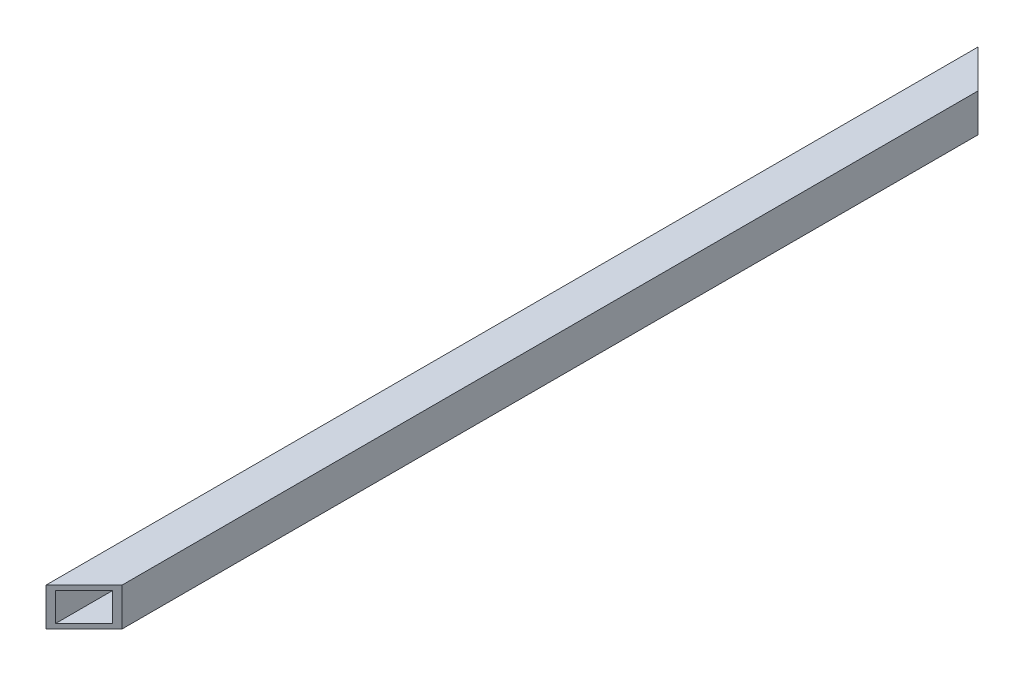
ISO-10303-21;
HEADER;
FILE_DESCRIPTION(('STEP AP214'),'2;1');
FILE_NAME('part.step','',(''),(''),'','','');
FILE_SCHEMA(('AUTOMOTIVE_DESIGN { 1 0 10303 214 1 1 1 1 }'));
ENDSEC;
DATA;
#1=APPLICATION_CONTEXT('core data for automotive mechanical design processes');
#2=APPLICATION_PROTOCOL_DEFINITION('international standard','automotive_design',2000,#1);
#3=PRODUCT_CONTEXT('',#1,'mechanical');
#4=PRODUCT('Part','Part','',(#3));
#5=PRODUCT_RELATED_PRODUCT_CATEGORY('part','',(#4));
#6=PRODUCT_DEFINITION_FORMATION('','',#4);
#7=PRODUCT_DEFINITION_CONTEXT('part definition',#1,'design');
#8=PRODUCT_DEFINITION('design','',#6,#7);
#9=PRODUCT_DEFINITION_SHAPE('','',#8);
#10=(LENGTH_UNIT() NAMED_UNIT(*) SI_UNIT(.MILLI.,.METRE.));
#11=(NAMED_UNIT(*) PLANE_ANGLE_UNIT() SI_UNIT($,.RADIAN.));
#12=(NAMED_UNIT(*) SI_UNIT($,.STERADIAN.) SOLID_ANGLE_UNIT());
#13=UNCERTAINTY_MEASURE_WITH_UNIT(LENGTH_MEASURE(1.E-05),#10,'distance_accuracy_value','');
#14=(GEOMETRIC_REPRESENTATION_CONTEXT(3) GLOBAL_UNCERTAINTY_ASSIGNED_CONTEXT((#13)) GLOBAL_UNIT_ASSIGNED_CONTEXT((#10,
#11,#12)) REPRESENTATION_CONTEXT('',''));
#15=CARTESIAN_POINT('',(0.,0.,0.));
#16=DIRECTION('',(0.,0.,1.));
#17=DIRECTION('',(1.,0.,0.));
#18=AXIS2_PLACEMENT_3D('',#15,#16,#17);
#19=CARTESIAN_POINT('',(-12.7,12.7,-311.15));
#20=DIRECTION('',(-0.70710678118655,0.,0.707106781186545));
#21=DIRECTION('',(0.707106781186545,0.,0.70710678118655));
#22=AXIS2_PLACEMENT_3D('',#19,#20,#21);
#23=PLANE('',#22);
#24=DIRECTION('',(0.707106781186545,0.,0.70710678118655));
#25=VECTOR('',#24,1.);
#26=CARTESIAN_POINT('',(71.4375,-12.7,-227.0125));
#27=LINE('',#26,#25);
#28=CARTESIAN_POINT('',(-12.7,-12.7,-311.15));
#29=VERTEX_POINT('',#28);
#30=CARTESIAN_POINT('',(12.7,-12.7,-285.75));
#31=VERTEX_POINT('',#30);
#32=EDGE_CURVE('E10',#29,#31,#27,.T.);
#33=ORIENTED_EDGE('',*,*,#32,.F.);
#34=DIRECTION('',(0.,-1.,0.));
#35=VECTOR('',#34,1.);
#36=CARTESIAN_POINT('',(-12.7,-12.7,-311.15));
#37=LINE('',#36,#35);
#38=CARTESIAN_POINT('',(-12.7,12.7,-311.15));
#39=VERTEX_POINT('',#38);
#40=EDGE_CURVE('E35',#39,#29,#37,.T.);
#41=ORIENTED_EDGE('',*,*,#40,.F.);
#42=DIRECTION('',(-0.707106781186545,0.,-0.70710678118655));
#43=VECTOR('',#42,1.);
#44=CARTESIAN_POINT('',(65.0875,12.7,-233.362499999999));
#45=LINE('',#44,#43);
#46=CARTESIAN_POINT('',(12.6999999999998,12.7,-285.75));
#47=VERTEX_POINT('',#46);
#48=EDGE_CURVE('E130',#47,#39,#45,.T.);
#49=ORIENTED_EDGE('',*,*,#48,.F.);
#50=DIRECTION('',(0.,1.,0.));
#51=VECTOR('',#50,1.);
#52=CARTESIAN_POINT('',(12.7,12.7,-285.75));
#53=LINE('',#52,#51);
#54=EDGE_CURVE('E114',#31,#47,#53,.T.);
#55=ORIENTED_EDGE('',*,*,#54,.F.);
#56=EDGE_LOOP('',(#33,#41,#49,#55));
#57=FACE_BOUND('',#56,.T.);
#58=DIRECTION('',(0.,-1.,0.));
#59=VECTOR('',#58,1.);
#60=CARTESIAN_POINT('',(9.52500000000001,11.1125,-288.925));
#61=LINE('',#60,#59);
#62=CARTESIAN_POINT('',(9.525,9.525,-288.925));
#63=VERTEX_POINT('',#62);
#64=CARTESIAN_POINT('',(9.525,-9.525,-288.925));
#65=VERTEX_POINT('',#64);
#66=EDGE_CURVE('E92',#63,#65,#61,.T.);
#67=ORIENTED_EDGE('',*,*,#66,.F.);
#68=DIRECTION('',(0.707106781186545,0.,0.70710678118655));
#69=VECTOR('',#68,1.);
#70=CARTESIAN_POINT('',(65.88125,9.525,-232.56875));
#71=LINE('',#70,#69);
#72=CARTESIAN_POINT('',(-9.525,9.525,-307.975));
#73=VERTEX_POINT('',#72);
#74=EDGE_CURVE('E100',#73,#63,#71,.T.);
#75=ORIENTED_EDGE('',*,*,#74,.F.);
#76=DIRECTION('',(0.,1.,0.));
#77=VECTOR('',#76,1.);
#78=CARTESIAN_POINT('',(-9.52500000000001,1.5875,-307.975));
#79=LINE('',#78,#77);
#80=CARTESIAN_POINT('',(-9.525,-9.525,-307.975));
#81=VERTEX_POINT('',#80);
#82=EDGE_CURVE('E101',#81,#73,#79,.T.);
#83=ORIENTED_EDGE('',*,*,#82,.F.);
#84=DIRECTION('',(-0.707106781186545,0.,-0.70710678118655));
#85=VECTOR('',#84,1.);
#86=CARTESIAN_POINT('',(70.64375,-9.525,-227.80625));
#87=LINE('',#86,#85);
#88=EDGE_CURVE('E111',#65,#81,#87,.T.);
#89=ORIENTED_EDGE('',*,*,#88,.F.);
#90=EDGE_LOOP('',(#67,#75,#83,#89));
#91=FACE_BOUND('',#90,.T.);
#92=ADVANCED_FACE('F16',(#57,#91),#23,.F.);
#93=CARTESIAN_POINT('',(12.7,12.7,285.75));
#94=DIRECTION('',(-0.707106781186548,0.,-0.707106781186547));
#95=DIRECTION('',(-0.707106781186547,0.,0.707106781186548));
#96=AXIS2_PLACEMENT_3D('',#93,#94,#95);
#97=PLANE('',#96);
#98=DIRECTION('',(-0.707106781186547,0.,0.707106781186548));
#99=VECTOR('',#98,1.);
#100=CARTESIAN_POINT('',(84.1375,-12.7,214.3125));
#101=LINE('',#100,#99);
#102=CARTESIAN_POINT('',(12.7,-12.7,285.75));
#103=VERTEX_POINT('',#102);
#104=CARTESIAN_POINT('',(-12.7,-12.7,311.15));
#105=VERTEX_POINT('',#104);
#106=EDGE_CURVE('E26',#103,#105,#101,.T.);
#107=ORIENTED_EDGE('',*,*,#106,.F.);
#108=DIRECTION('',(0.,-1.,0.));
#109=VECTOR('',#108,1.);
#110=CARTESIAN_POINT('',(12.7,12.7,285.75));
#111=LINE('',#110,#109);
#112=CARTESIAN_POINT('',(12.7,12.7,285.75));
#113=VERTEX_POINT('',#112);
#114=EDGE_CURVE('E117',#113,#103,#111,.T.);
#115=ORIENTED_EDGE('',*,*,#114,.F.);
#116=DIRECTION('',(0.707106781186547,0.,-0.707106781186548));
#117=VECTOR('',#116,1.);
#118=CARTESIAN_POINT('',(77.7875,12.7,220.6625));
#119=LINE('',#118,#117);
#120=CARTESIAN_POINT('',(-12.7,12.7,311.15));
#121=VERTEX_POINT('',#120);
#122=EDGE_CURVE('E133',#121,#113,#119,.T.);
#123=ORIENTED_EDGE('',*,*,#122,.F.);
#124=DIRECTION('',(0.,1.,0.));
#125=VECTOR('',#124,1.);
#126=CARTESIAN_POINT('',(-12.7,-12.7,311.15));
#127=LINE('',#126,#125);
#128=EDGE_CURVE('E126',#105,#121,#127,.T.);
#129=ORIENTED_EDGE('',*,*,#128,.F.);
#130=EDGE_LOOP('',(#107,#115,#123,#129));
#131=FACE_BOUND('',#130,.T.);
#132=DIRECTION('',(0.,1.,0.));
#133=VECTOR('',#132,1.);
#134=CARTESIAN_POINT('',(9.52500000000001,11.1125,288.925));
#135=LINE('',#134,#133);
#136=CARTESIAN_POINT('',(9.525,-9.525,288.925));
#137=VERTEX_POINT('',#136);
#138=CARTESIAN_POINT('',(9.525,9.525,288.925));
#139=VERTEX_POINT('',#138);
#140=EDGE_CURVE('E120',#137,#139,#135,.T.);
#141=ORIENTED_EDGE('',*,*,#140,.F.);
#142=DIRECTION('',(0.707106781186547,0.,-0.707106781186548));
#143=VECTOR('',#142,1.);
#144=CARTESIAN_POINT('',(83.34375,-9.525,215.10625));
#145=LINE('',#144,#143);
#146=CARTESIAN_POINT('',(-9.525,-9.525,307.975));
#147=VERTEX_POINT('',#146);
#148=EDGE_CURVE('E79',#147,#137,#145,.T.);
#149=ORIENTED_EDGE('',*,*,#148,.F.);
#150=DIRECTION('',(0.,-1.,0.));
#151=VECTOR('',#150,1.);
#152=CARTESIAN_POINT('',(-9.52499999999998,1.5875,307.975));
#153=LINE('',#152,#151);
#154=CARTESIAN_POINT('',(-9.525,9.525,307.975));
#155=VERTEX_POINT('',#154);
#156=EDGE_CURVE('E82',#155,#147,#153,.T.);
#157=ORIENTED_EDGE('',*,*,#156,.F.);
#158=DIRECTION('',(-0.707106781186547,0.,0.707106781186548));
#159=VECTOR('',#158,1.);
#160=CARTESIAN_POINT('',(78.58125,9.525,219.86875));
#161=LINE('',#160,#159);
#162=EDGE_CURVE('E85',#139,#155,#161,.T.);
#163=ORIENTED_EDGE('',*,*,#162,.F.);
#164=EDGE_LOOP('',(#141,#149,#157,#163));
#165=FACE_BOUND('',#164,.T.);
#166=ADVANCED_FACE('F84',(#131,#165),#97,.F.);
#167=CARTESIAN_POINT('',(12.7,-12.7,0.));
#168=DIRECTION('',(0.,-1.,0.));
#169=DIRECTION('',(0.,0.,-1.));
#170=AXIS2_PLACEMENT_3D('',#167,#168,#169);
#171=PLANE('',#170);
#172=ORIENTED_EDGE('',*,*,#32,.T.);
#173=DIRECTION('',(0.,0.,-1.));
#174=VECTOR('',#173,1.);
#175=CARTESIAN_POINT('',(12.7,-12.7,0.));
#176=LINE('',#175,#174);
#177=EDGE_CURVE('E123',#103,#31,#176,.T.);
#178=ORIENTED_EDGE('',*,*,#177,.F.);
#179=ORIENTED_EDGE('',*,*,#106,.T.);
#180=DIRECTION('',(0.,0.,-1.));
#181=VECTOR('',#180,1.);
#182=CARTESIAN_POINT('',(-12.7,-12.7,0.));
#183=LINE('',#182,#181);
#184=EDGE_CURVE('E127',#105,#29,#183,.T.);
#185=ORIENTED_EDGE('',*,*,#184,.T.);
#186=EDGE_LOOP('',(#172,#178,#179,#185));
#187=FACE_BOUND('',#186,.T.);
#188=ADVANCED_FACE('F165',(#187),#171,.T.);
#189=CARTESIAN_POINT('',(-12.7,12.7,0.));
#190=DIRECTION('',(0.,1.,0.));
#191=DIRECTION('',(0.,0.,1.));
#192=AXIS2_PLACEMENT_3D('',#189,#190,#191);
#193=PLANE('',#192);
#194=ORIENTED_EDGE('',*,*,#48,.T.);
#195=DIRECTION('',(0.,0.,1.));
#196=VECTOR('',#195,1.);
#197=CARTESIAN_POINT('',(-12.7,12.7,0.));
#198=LINE('',#197,#196);
#199=EDGE_CURVE('E131',#39,#121,#198,.T.);
#200=ORIENTED_EDGE('',*,*,#199,.T.);
#201=ORIENTED_EDGE('',*,*,#122,.T.);
#202=DIRECTION('',(0.,0.,-1.));
#203=VECTOR('',#202,1.);
#204=CARTESIAN_POINT('',(12.7,12.7,0.));
#205=LINE('',#204,#203);
#206=EDGE_CURVE('E134',#113,#47,#205,.T.);
#207=ORIENTED_EDGE('',*,*,#206,.T.);
#208=EDGE_LOOP('',(#194,#200,#201,#207));
#209=FACE_BOUND('',#208,.T.);
#210=ADVANCED_FACE('F150',(#209),#193,.T.);
#211=CARTESIAN_POINT('',(-9.525,9.525,0.));
#212=DIRECTION('',(0.,1.,0.));
#213=DIRECTION('',(0.,0.,1.));
#214=AXIS2_PLACEMENT_3D('',#211,#212,#213);
#215=PLANE('',#214);
#216=ORIENTED_EDGE('',*,*,#74,.T.);
#217=DIRECTION('',(0.,0.,-1.));
#218=VECTOR('',#217,1.);
#219=CARTESIAN_POINT('',(9.525,9.525,0.));
#220=LINE('',#219,#218);
#221=EDGE_CURVE('E99',#139,#63,#220,.T.);
#222=ORIENTED_EDGE('',*,*,#221,.F.);
#223=ORIENTED_EDGE('',*,*,#162,.T.);
#224=DIRECTION('',(0.,0.,1.));
#225=VECTOR('',#224,1.);
#226=CARTESIAN_POINT('',(-9.525,9.525,0.));
#227=LINE('',#226,#225);
#228=EDGE_CURVE('E91',#73,#155,#227,.T.);
#229=ORIENTED_EDGE('',*,*,#228,.F.);
#230=EDGE_LOOP('',(#216,#222,#223,#229));
#231=FACE_BOUND('',#230,.T.);
#232=ADVANCED_FACE('F97',(#231),#215,.F.);
#233=CARTESIAN_POINT('',(-9.525,-9.525,0.));
#234=DIRECTION('',(-1.,0.,0.));
#235=DIRECTION('',(0.,0.,1.));
#236=AXIS2_PLACEMENT_3D('',#233,#234,#235);
#237=PLANE('',#236);
#238=ORIENTED_EDGE('',*,*,#82,.T.);
#239=ORIENTED_EDGE('',*,*,#228,.T.);
#240=ORIENTED_EDGE('',*,*,#156,.T.);
#241=DIRECTION('',(0.,0.,1.));
#242=VECTOR('',#241,1.);
#243=CARTESIAN_POINT('',(-9.525,-9.525,0.));
#244=LINE('',#243,#242);
#245=EDGE_CURVE('E110',#81,#147,#244,.T.);
#246=ORIENTED_EDGE('',*,*,#245,.F.);
#247=EDGE_LOOP('',(#238,#239,#240,#246));
#248=FACE_BOUND('',#247,.T.);
#249=ADVANCED_FACE('F103',(#248),#237,.F.);
#250=CARTESIAN_POINT('',(9.525,9.525,0.));
#251=DIRECTION('',(1.,0.,0.));
#252=DIRECTION('',(0.,0.,-1.));
#253=AXIS2_PLACEMENT_3D('',#250,#251,#252);
#254=PLANE('',#253);
#255=ORIENTED_EDGE('',*,*,#66,.T.);
#256=DIRECTION('',(0.,0.,1.));
#257=VECTOR('',#256,1.);
#258=CARTESIAN_POINT('',(9.525,-9.525,0.));
#259=LINE('',#258,#257);
#260=EDGE_CURVE('E20',#65,#137,#259,.T.);
#261=ORIENTED_EDGE('',*,*,#260,.T.);
#262=ORIENTED_EDGE('',*,*,#140,.T.);
#263=ORIENTED_EDGE('',*,*,#221,.T.);
#264=EDGE_LOOP('',(#255,#261,#262,#263));
#265=FACE_BOUND('',#264,.T.);
#266=ADVANCED_FACE('F179',(#265),#254,.F.);
#267=CARTESIAN_POINT('',(9.525,-9.525,0.));
#268=DIRECTION('',(0.,-1.,0.));
#269=DIRECTION('',(0.,0.,-1.));
#270=AXIS2_PLACEMENT_3D('',#267,#268,#269);
#271=PLANE('',#270);
#272=ORIENTED_EDGE('',*,*,#88,.T.);
#273=ORIENTED_EDGE('',*,*,#245,.T.);
#274=ORIENTED_EDGE('',*,*,#148,.T.);
#275=ORIENTED_EDGE('',*,*,#260,.F.);
#276=EDGE_LOOP('',(#272,#273,#274,#275));
#277=FACE_BOUND('',#276,.T.);
#278=ADVANCED_FACE('F158',(#277),#271,.F.);
#279=CARTESIAN_POINT('',(12.7,12.7,0.));
#280=DIRECTION('',(1.,0.,0.));
#281=DIRECTION('',(0.,0.,-1.));
#282=AXIS2_PLACEMENT_3D('',#279,#280,#281);
#283=PLANE('',#282);
#284=ORIENTED_EDGE('',*,*,#54,.T.);
#285=ORIENTED_EDGE('',*,*,#206,.F.);
#286=ORIENTED_EDGE('',*,*,#114,.T.);
#287=ORIENTED_EDGE('',*,*,#177,.T.);
#288=EDGE_LOOP('',(#284,#285,#286,#287));
#289=FACE_BOUND('',#288,.T.);
#290=ADVANCED_FACE('F153',(#289),#283,.T.);
#291=CARTESIAN_POINT('',(-12.7,-12.7,0.));
#292=DIRECTION('',(-1.,0.,0.));
#293=DIRECTION('',(0.,0.,1.));
#294=AXIS2_PLACEMENT_3D('',#291,#292,#293);
#295=PLANE('',#294);
#296=ORIENTED_EDGE('',*,*,#128,.T.);
#297=ORIENTED_EDGE('',*,*,#199,.F.);
#298=ORIENTED_EDGE('',*,*,#40,.T.);
#299=ORIENTED_EDGE('',*,*,#184,.F.);
#300=EDGE_LOOP('',(#296,#297,#298,#299));
#301=FACE_BOUND('',#300,.T.);
#302=ADVANCED_FACE('F18',(#301),#295,.T.);
#303=CLOSED_SHELL('',(#92,#166,#188,#210,#232,#249,#266,#278,#290,#302));
#304=MANIFOLD_SOLID_BREP('B1',#303);
#305=ADVANCED_BREP_SHAPE_REPRESENTATION('',(#18,#304),#14);
#306=SHAPE_DEFINITION_REPRESENTATION(#9,#305);
ENDSEC;
END-ISO-10303-21;
